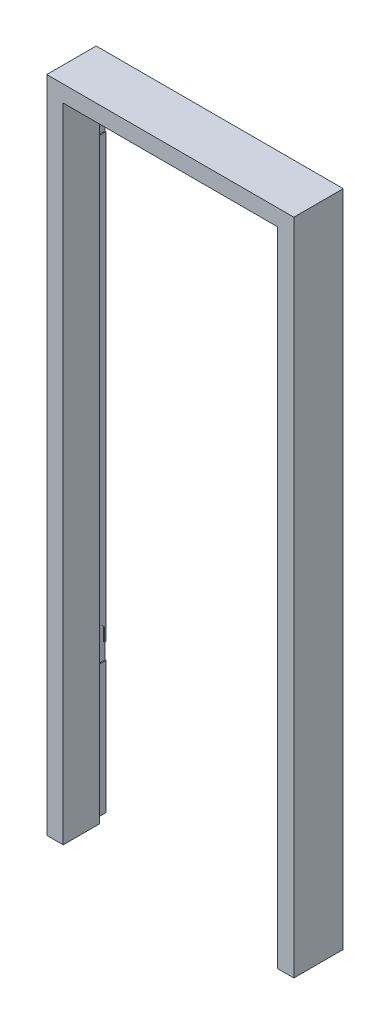
ISO-10303-21;
HEADER;
FILE_DESCRIPTION(('STEP AP214'),'2;1');
FILE_NAME('part.step','',(''),(''),'','','');
FILE_SCHEMA(('AUTOMOTIVE_DESIGN { 1 0 10303 214 1 1 1 1 }'));
ENDSEC;
DATA;
#1=APPLICATION_CONTEXT('core data for automotive mechanical design processes');
#2=APPLICATION_PROTOCOL_DEFINITION('international standard','automotive_design',2000,#1);
#3=PRODUCT_CONTEXT('',#1,'mechanical');
#4=PRODUCT('Part','Part','',(#3));
#5=PRODUCT_RELATED_PRODUCT_CATEGORY('part','',(#4));
#6=PRODUCT_DEFINITION_FORMATION('','',#4);
#7=PRODUCT_DEFINITION_CONTEXT('part definition',#1,'design');
#8=PRODUCT_DEFINITION('design','',#6,#7);
#9=PRODUCT_DEFINITION_SHAPE('','',#8);
#10=(LENGTH_UNIT() NAMED_UNIT(*) SI_UNIT(.MILLI.,.METRE.));
#11=(NAMED_UNIT(*) PLANE_ANGLE_UNIT() SI_UNIT($,.RADIAN.));
#12=(NAMED_UNIT(*) SI_UNIT($,.STERADIAN.) SOLID_ANGLE_UNIT());
#13=UNCERTAINTY_MEASURE_WITH_UNIT(LENGTH_MEASURE(1.E-05),#10,'distance_accuracy_value','');
#14=(GEOMETRIC_REPRESENTATION_CONTEXT(3) GLOBAL_UNCERTAINTY_ASSIGNED_CONTEXT((#13)) GLOBAL_UNIT_ASSIGNED_CONTEXT((#10,
#11,#12)) REPRESENTATION_CONTEXT('',''));
#15=CARTESIAN_POINT('',(0.,0.,0.));
#16=DIRECTION('',(0.,0.,1.));
#17=DIRECTION('',(1.,0.,0.));
#18=AXIS2_PLACEMENT_3D('',#15,#16,#17);
#19=CARTESIAN_POINT('',(-700.,-2000.,150.));
#20=DIRECTION('',(-1.,0.,0.));
#21=DIRECTION('',(0.,0.,1.));
#22=AXIS2_PLACEMENT_3D('',#19,#20,#21);
#23=PLANE('',#22);
#24=DIRECTION('',(0.,-1.,0.));
#25=VECTOR('',#24,1.);
#26=CARTESIAN_POINT('',(-700.,-2000.,40.));
#27=LINE('',#26,#25);
#28=CARTESIAN_POINT('',(-700.,-50.0000000000001,40.));
#29=VERTEX_POINT('',#28);
#30=CARTESIAN_POINT('',(-700.,-2000.,40.));
#31=VERTEX_POINT('',#30);
#32=EDGE_CURVE('E452',#29,#31,#27,.T.);
#33=ORIENTED_EDGE('',*,*,#32,.F.);
#34=DIRECTION('',(0.,0.,-1.));
#35=VECTOR('',#34,1.);
#36=CARTESIAN_POINT('',(-700.,-50.0000000000001,150.));
#37=LINE('',#36,#35);
#38=CARTESIAN_POINT('',(-700.,-50.0000000000001,150.));
#39=VERTEX_POINT('',#38);
#40=EDGE_CURVE('E509',#39,#29,#37,.T.);
#41=ORIENTED_EDGE('',*,*,#40,.F.);
#42=DIRECTION('',(0.,1.,0.));
#43=VECTOR('',#42,1.);
#44=CARTESIAN_POINT('',(-700.,-2000.,150.));
#45=LINE('',#44,#43);
#46=CARTESIAN_POINT('',(-700.,-2000.,150.));
#47=VERTEX_POINT('',#46);
#48=EDGE_CURVE('E470',#47,#39,#45,.T.);
#49=ORIENTED_EDGE('',*,*,#48,.F.);
#50=DIRECTION('',(0.,0.,-1.));
#51=VECTOR('',#50,1.);
#52=CARTESIAN_POINT('',(-700.,-2000.,150.));
#53=LINE('',#52,#51);
#54=EDGE_CURVE('E513',#47,#31,#53,.T.);
#55=ORIENTED_EDGE('',*,*,#54,.T.);
#56=EDGE_LOOP('',(#33,#41,#49,#55));
#57=FACE_BOUND('',#56,.T.);
#58=ADVANCED_FACE('F41',(#57),#23,.F.);
#59=CARTESIAN_POINT('',(-49.9999999999998,-50.,150.));
#60=DIRECTION('',(0.,1.,0.));
#61=DIRECTION('',(-1.,0.,0.));
#62=AXIS2_PLACEMENT_3D('',#59,#60,#61);
#63=PLANE('',#62);
#64=DIRECTION('',(-1.,0.,0.));
#65=VECTOR('',#64,1.);
#66=CARTESIAN_POINT('',(-49.9999999999998,-50.,40.));
#67=LINE('',#66,#65);
#68=CARTESIAN_POINT('',(-49.9999999999998,-49.9999999999998,40.));
#69=VERTEX_POINT('',#68);
#70=EDGE_CURVE('E449',#69,#29,#67,.T.);
#71=ORIENTED_EDGE('',*,*,#70,.F.);
#72=DIRECTION('',(0.,0.,-1.));
#73=VECTOR('',#72,1.);
#74=CARTESIAN_POINT('',(-49.9999999999998,-50.,150.));
#75=LINE('',#74,#73);
#76=CARTESIAN_POINT('',(-49.9999999999998,-50.,150.));
#77=VERTEX_POINT('',#76);
#78=EDGE_CURVE('E505',#77,#69,#75,.T.);
#79=ORIENTED_EDGE('',*,*,#78,.F.);
#80=DIRECTION('',(1.,0.,0.));
#81=VECTOR('',#80,1.);
#82=CARTESIAN_POINT('',(-49.9999999999998,-50.,150.));
#83=LINE('',#82,#81);
#84=EDGE_CURVE('E473',#39,#77,#83,.T.);
#85=ORIENTED_EDGE('',*,*,#84,.F.);
#86=ORIENTED_EDGE('',*,*,#40,.T.);
#87=EDGE_LOOP('',(#71,#79,#85,#86));
#88=FACE_BOUND('',#87,.T.);
#89=ADVANCED_FACE('F601',(#88),#63,.F.);
#90=CARTESIAN_POINT('',(-49.9999999999998,-2000.,150.));
#91=DIRECTION('',(1.,0.,0.));
#92=DIRECTION('',(0.,1.,0.));
#93=AXIS2_PLACEMENT_3D('',#90,#91,#92);
#94=PLANE('',#93);
#95=DIRECTION('',(0.,1.,0.));
#96=VECTOR('',#95,1.);
#97=CARTESIAN_POINT('',(-49.9999999999998,-2000.,40.));
#98=LINE('',#97,#96);
#99=CARTESIAN_POINT('',(-49.9999999999998,-2000.,40.));
#100=VERTEX_POINT('',#99);
#101=EDGE_CURVE('E436',#100,#69,#98,.T.);
#102=ORIENTED_EDGE('',*,*,#101,.F.);
#103=DIRECTION('',(0.,0.,-1.));
#104=VECTOR('',#103,1.);
#105=CARTESIAN_POINT('',(-49.9999999999998,-2000.,150.));
#106=LINE('',#105,#104);
#107=CARTESIAN_POINT('',(-49.9999999999998,-2000.,150.));
#108=VERTEX_POINT('',#107);
#109=EDGE_CURVE('E501',#108,#100,#106,.T.);
#110=ORIENTED_EDGE('',*,*,#109,.F.);
#111=DIRECTION('',(0.,-1.,0.));
#112=VECTOR('',#111,1.);
#113=CARTESIAN_POINT('',(-49.9999999999998,-2000.,150.));
#114=LINE('',#113,#112);
#115=EDGE_CURVE('E476',#77,#108,#114,.T.);
#116=ORIENTED_EDGE('',*,*,#115,.F.);
#117=ORIENTED_EDGE('',*,*,#78,.T.);
#118=EDGE_LOOP('',(#102,#110,#116,#117));
#119=FACE_BOUND('',#118,.T.);
#120=ADVANCED_FACE('F607',(#119),#94,.F.);
#121=CARTESIAN_POINT('',(0.,0.,150.));
#122=DIRECTION('',(-1.,0.,0.));
#123=DIRECTION('',(0.,0.,1.));
#124=AXIS2_PLACEMENT_3D('',#121,#122,#123);
#125=PLANE('',#124);
#126=DIRECTION('',(0.,1.,0.));
#127=VECTOR('',#126,1.);
#128=CARTESIAN_POINT('',(0.,0.,0.));
#129=LINE('',#128,#127);
#130=CARTESIAN_POINT('',(0.,-2000.,0.));
#131=VERTEX_POINT('',#130);
#132=CARTESIAN_POINT('',(0.,0.,0.));
#133=VERTEX_POINT('',#132);
#134=EDGE_CURVE('E455',#131,#133,#129,.T.);
#135=ORIENTED_EDGE('',*,*,#134,.T.);
#136=DIRECTION('',(0.,0.,-1.));
#137=VECTOR('',#136,1.);
#138=CARTESIAN_POINT('',(0.,0.,150.));
#139=LINE('',#138,#137);
#140=CARTESIAN_POINT('',(0.,0.,150.));
#141=VERTEX_POINT('',#140);
#142=EDGE_CURVE('E11',#141,#133,#139,.T.);
#143=ORIENTED_EDGE('',*,*,#142,.F.);
#144=DIRECTION('',(0.,1.,0.));
#145=VECTOR('',#144,1.);
#146=CARTESIAN_POINT('',(0.,0.,150.));
#147=LINE('',#146,#145);
#148=CARTESIAN_POINT('',(0.,-2000.,150.));
#149=VERTEX_POINT('',#148);
#150=EDGE_CURVE('E456',#149,#141,#147,.T.);
#151=ORIENTED_EDGE('',*,*,#150,.F.);
#152=DIRECTION('',(0.,0.,-1.));
#153=VECTOR('',#152,1.);
#154=CARTESIAN_POINT('',(0.,-2000.,150.));
#155=LINE('',#154,#153);
#156=EDGE_CURVE('E482',#149,#131,#155,.T.);
#157=ORIENTED_EDGE('',*,*,#156,.T.);
#158=EDGE_LOOP('',(#135,#143,#151,#157));
#159=FACE_BOUND('',#158,.T.);
#160=ADVANCED_FACE('F43',(#159),#125,.F.);
#161=CARTESIAN_POINT('',(0.,0.,150.));
#162=DIRECTION('',(0.,-1.,0.));
#163=DIRECTION('',(1.,0.,0.));
#164=AXIS2_PLACEMENT_3D('',#161,#162,#163);
#165=PLANE('',#164);
#166=DIRECTION('',(-1.,0.,0.));
#167=VECTOR('',#166,1.);
#168=CARTESIAN_POINT('',(0.,0.,0.));
#169=LINE('',#168,#167);
#170=CARTESIAN_POINT('',(-750.,0.,0.));
#171=VERTEX_POINT('',#170);
#172=EDGE_CURVE('E486',#133,#171,#169,.T.);
#173=ORIENTED_EDGE('',*,*,#172,.T.);
#174=DIRECTION('',(0.,0.,-1.));
#175=VECTOR('',#174,1.);
#176=CARTESIAN_POINT('',(-750.,0.,150.));
#177=LINE('',#176,#175);
#178=CARTESIAN_POINT('',(-750.,0.,150.));
#179=VERTEX_POINT('',#178);
#180=EDGE_CURVE('E50',#179,#171,#177,.T.);
#181=ORIENTED_EDGE('',*,*,#180,.F.);
#182=DIRECTION('',(-1.,0.,0.));
#183=VECTOR('',#182,1.);
#184=CARTESIAN_POINT('',(0.,0.,150.));
#185=LINE('',#184,#183);
#186=EDGE_CURVE('E460',#141,#179,#185,.T.);
#187=ORIENTED_EDGE('',*,*,#186,.F.);
#188=ORIENTED_EDGE('',*,*,#142,.T.);
#189=EDGE_LOOP('',(#173,#181,#187,#188));
#190=FACE_BOUND('',#189,.T.);
#191=ADVANCED_FACE('F544',(#190),#165,.F.);
#192=CARTESIAN_POINT('',(-750.,0.,150.));
#193=DIRECTION('',(1.,0.,0.));
#194=DIRECTION('',(0.,1.,0.));
#195=AXIS2_PLACEMENT_3D('',#192,#193,#194);
#196=PLANE('',#195);
#197=DIRECTION('',(0.,-1.,0.));
#198=VECTOR('',#197,1.);
#199=CARTESIAN_POINT('',(-750.,0.,0.));
#200=LINE('',#199,#198);
#201=CARTESIAN_POINT('',(-750.,-2000.,0.));
#202=VERTEX_POINT('',#201);
#203=EDGE_CURVE('E489',#171,#202,#200,.T.);
#204=ORIENTED_EDGE('',*,*,#203,.T.);
#205=DIRECTION('',(0.,0.,-1.));
#206=VECTOR('',#205,1.);
#207=CARTESIAN_POINT('',(-750.,-2000.,150.));
#208=LINE('',#207,#206);
#209=CARTESIAN_POINT('',(-750.,-2000.,150.));
#210=VERTEX_POINT('',#209);
#211=EDGE_CURVE('E517',#210,#202,#208,.T.);
#212=ORIENTED_EDGE('',*,*,#211,.F.);
#213=DIRECTION('',(0.,-1.,0.));
#214=VECTOR('',#213,1.);
#215=CARTESIAN_POINT('',(-750.,0.,150.));
#216=LINE('',#215,#214);
#217=EDGE_CURVE('E464',#179,#210,#216,.T.);
#218=ORIENTED_EDGE('',*,*,#217,.F.);
#219=ORIENTED_EDGE('',*,*,#180,.T.);
#220=EDGE_LOOP('',(#204,#212,#218,#219));
#221=FACE_BOUND('',#220,.T.);
#222=ADVANCED_FACE('F526',(#221),#196,.F.);
#223=CARTESIAN_POINT('',(-750.,-2000.,150.));
#224=DIRECTION('',(0.,1.,0.));
#225=DIRECTION('',(0.,0.,1.));
#226=AXIS2_PLACEMENT_3D('',#223,#224,#225);
#227=PLANE('',#226);
#228=DIRECTION('',(1.,0.,0.));
#229=VECTOR('',#228,1.);
#230=CARTESIAN_POINT('',(-750.,-2000.,0.));
#231=LINE('',#230,#229);
#232=CARTESIAN_POINT('',(-720.,-2000.,0.));
#233=VERTEX_POINT('',#232);
#234=EDGE_CURVE('E492',#202,#233,#231,.T.);
#235=ORIENTED_EDGE('',*,*,#234,.T.);
#236=DIRECTION('',(0.,0.,-1.));
#237=VECTOR('',#236,1.);
#238=CARTESIAN_POINT('',(-720.,-2000.,40.));
#239=LINE('',#238,#237);
#240=CARTESIAN_POINT('',(-720.,-2000.,40.));
#241=VERTEX_POINT('',#240);
#242=EDGE_CURVE('E441',#241,#233,#239,.T.);
#243=ORIENTED_EDGE('',*,*,#242,.F.);
#244=DIRECTION('',(-1.,0.,0.));
#245=VECTOR('',#244,1.);
#246=CARTESIAN_POINT('',(-30.0000000000002,-2000.,40.));
#247=LINE('',#246,#245);
#248=EDGE_CURVE('E408',#31,#241,#247,.T.);
#249=ORIENTED_EDGE('',*,*,#248,.F.);
#250=ORIENTED_EDGE('',*,*,#54,.F.);
#251=DIRECTION('',(1.,0.,0.));
#252=VECTOR('',#251,1.);
#253=CARTESIAN_POINT('',(-750.,-2000.,150.));
#254=LINE('',#253,#252);
#255=EDGE_CURVE('E467',#210,#47,#254,.T.);
#256=ORIENTED_EDGE('',*,*,#255,.F.);
#257=ORIENTED_EDGE('',*,*,#211,.T.);
#258=EDGE_LOOP('',(#235,#243,#249,#250,#256,#257));
#259=FACE_BOUND('',#258,.T.);
#260=ADVANCED_FACE('F534',(#259),#227,.F.);
#261=CARTESIAN_POINT('',(-49.9999999999998,-2000.,150.));
#262=DIRECTION('',(0.,1.,0.));
#263=DIRECTION('',(0.,0.,1.));
#264=AXIS2_PLACEMENT_3D('',#261,#262,#263);
#265=PLANE('',#264);
#266=CARTESIAN_POINT('',(-30.0000000000002,-2000.,40.));
#267=VERTEX_POINT('',#266);
#268=EDGE_CURVE('E410',#267,#100,#247,.T.);
#269=ORIENTED_EDGE('',*,*,#268,.F.);
#270=DIRECTION('',(0.,0.,-1.));
#271=VECTOR('',#270,1.);
#272=CARTESIAN_POINT('',(-30.0000000000002,-2000.,40.));
#273=LINE('',#272,#271);
#274=CARTESIAN_POINT('',(-30.0000000000002,-2000.,0.));
#275=VERTEX_POINT('',#274);
#276=EDGE_CURVE('E421',#267,#275,#273,.T.);
#277=ORIENTED_EDGE('',*,*,#276,.T.);
#278=DIRECTION('',(1.,0.,0.));
#279=VECTOR('',#278,1.);
#280=CARTESIAN_POINT('',(-49.9999999999998,-2000.,0.));
#281=LINE('',#280,#279);
#282=EDGE_CURVE('E461',#275,#131,#281,.T.);
#283=ORIENTED_EDGE('',*,*,#282,.T.);
#284=ORIENTED_EDGE('',*,*,#156,.F.);
#285=DIRECTION('',(1.,0.,0.));
#286=VECTOR('',#285,1.);
#287=CARTESIAN_POINT('',(-49.9999999999998,-2000.,150.));
#288=LINE('',#287,#286);
#289=EDGE_CURVE('E479',#108,#149,#288,.T.);
#290=ORIENTED_EDGE('',*,*,#289,.F.);
#291=ORIENTED_EDGE('',*,*,#109,.T.);
#292=EDGE_LOOP('',(#269,#277,#283,#284,#290,#291));
#293=FACE_BOUND('',#292,.T.);
#294=ADVANCED_FACE('F552',(#293),#265,.F.);
#295=CARTESIAN_POINT('',(0.,0.,150.));
#296=DIRECTION('',(0.,0.,1.));
#297=DIRECTION('',(1.,0.,0.));
#298=AXIS2_PLACEMENT_3D('',#295,#296,#297);
#299=PLANE('',#298);
#300=ORIENTED_EDGE('',*,*,#150,.T.);
#301=ORIENTED_EDGE('',*,*,#186,.T.);
#302=ORIENTED_EDGE('',*,*,#217,.T.);
#303=ORIENTED_EDGE('',*,*,#255,.T.);
#304=ORIENTED_EDGE('',*,*,#48,.T.);
#305=ORIENTED_EDGE('',*,*,#84,.T.);
#306=ORIENTED_EDGE('',*,*,#115,.T.);
#307=ORIENTED_EDGE('',*,*,#289,.T.);
#308=EDGE_LOOP('',(#300,#301,#302,#303,#304,#305,#306,#307));
#309=FACE_BOUND('',#308,.T.);
#310=ADVANCED_FACE('F540',(#309),#299,.T.);
#311=CARTESIAN_POINT('',(0.,0.,0.));
#312=DIRECTION('',(0.,0.,1.));
#313=DIRECTION('',(1.,0.,0.));
#314=AXIS2_PLACEMENT_3D('',#311,#312,#313);
#315=PLANE('',#314);
#316=DIRECTION('',(0.,1.,0.));
#317=VECTOR('',#316,1.);
#318=CARTESIAN_POINT('',(-723.,-160.,0.));
#319=LINE('',#318,#317);
#320=CARTESIAN_POINT('',(-723.,-210.,0.));
#321=VERTEX_POINT('',#320);
#322=CARTESIAN_POINT('',(-723.,-160.,0.));
#323=VERTEX_POINT('',#322);
#324=EDGE_CURVE('E246',#321,#323,#319,.T.);
#325=ORIENTED_EDGE('',*,*,#324,.F.);
#326=DIRECTION('',(1.,0.,0.));
#327=VECTOR('',#326,1.);
#328=CARTESIAN_POINT('',(-723.,-210.,0.));
#329=LINE('',#328,#327);
#330=CARTESIAN_POINT('',(-720.,-210.,0.));
#331=VERTEX_POINT('',#330);
#332=EDGE_CURVE('E228',#321,#331,#329,.T.);
#333=ORIENTED_EDGE('',*,*,#332,.T.);
#334=DIRECTION('',(0.,1.,0.));
#335=VECTOR('',#334,1.);
#336=CARTESIAN_POINT('',(-720.,-30.,0.));
#337=LINE('',#336,#335);
#338=CARTESIAN_POINT('',(-720.,-1550.,0.));
#339=VERTEX_POINT('',#338);
#340=EDGE_CURVE('E429',#339,#331,#337,.T.);
#341=ORIENTED_EDGE('',*,*,#340,.F.);
#342=DIRECTION('',(1.,0.,0.));
#343=VECTOR('',#342,1.);
#344=CARTESIAN_POINT('',(-723.,-1550.,0.));
#345=LINE('',#344,#343);
#346=CARTESIAN_POINT('',(-723.,-1550.,0.));
#347=VERTEX_POINT('',#346);
#348=EDGE_CURVE('E348',#347,#339,#345,.T.);
#349=ORIENTED_EDGE('',*,*,#348,.F.);
#350=DIRECTION('',(0.,1.,0.));
#351=VECTOR('',#350,1.);
#352=CARTESIAN_POINT('',(-723.,-1550.,0.));
#353=LINE('',#352,#351);
#354=CARTESIAN_POINT('',(-723.,-1600.,0.));
#355=VERTEX_POINT('',#354);
#356=EDGE_CURVE('E314',#355,#347,#353,.T.);
#357=ORIENTED_EDGE('',*,*,#356,.F.);
#358=DIRECTION('',(1.,0.,0.));
#359=VECTOR('',#358,1.);
#360=CARTESIAN_POINT('',(-723.,-1600.,0.));
#361=LINE('',#360,#359);
#362=CARTESIAN_POINT('',(-720.,-1600.,0.));
#363=VERTEX_POINT('',#362);
#364=EDGE_CURVE('E351',#355,#363,#361,.T.);
#365=ORIENTED_EDGE('',*,*,#364,.T.);
#366=EDGE_CURVE('E425',#233,#363,#337,.T.);
#367=ORIENTED_EDGE('',*,*,#366,.F.);
#368=ORIENTED_EDGE('',*,*,#234,.F.);
#369=ORIENTED_EDGE('',*,*,#203,.F.);
#370=ORIENTED_EDGE('',*,*,#172,.F.);
#371=ORIENTED_EDGE('',*,*,#134,.F.);
#372=ORIENTED_EDGE('',*,*,#282,.F.);
#373=DIRECTION('',(0.,-1.,0.));
#374=VECTOR('',#373,1.);
#375=CARTESIAN_POINT('',(-30.,-30.,0.));
#376=LINE('',#375,#374);
#377=CARTESIAN_POINT('',(-30.,-30.,0.));
#378=VERTEX_POINT('',#377);
#379=EDGE_CURVE('E394',#378,#275,#376,.T.);
#380=ORIENTED_EDGE('',*,*,#379,.F.);
#381=DIRECTION('',(1.,0.,0.));
#382=VECTOR('',#381,1.);
#383=CARTESIAN_POINT('',(-30.,-30.,0.));
#384=LINE('',#383,#382);
#385=CARTESIAN_POINT('',(-720.,-30.,0.));
#386=VERTEX_POINT('',#385);
#387=EDGE_CURVE('E409',#386,#378,#384,.T.);
#388=ORIENTED_EDGE('',*,*,#387,.F.);
#389=CARTESIAN_POINT('',(-720.,-160.,0.));
#390=VERTEX_POINT('',#389);
#391=EDGE_CURVE('E424',#390,#386,#337,.T.);
#392=ORIENTED_EDGE('',*,*,#391,.F.);
#393=DIRECTION('',(1.,0.,0.));
#394=VECTOR('',#393,1.);
#395=CARTESIAN_POINT('',(-723.,-160.,0.));
#396=LINE('',#395,#394);
#397=EDGE_CURVE('E65',#323,#390,#396,.T.);
#398=ORIENTED_EDGE('',*,*,#397,.F.);
#399=EDGE_LOOP('',(#325,#333,#341,#349,#357,#365,#367,#368,#369,#370,#371,#372,#380,#388,#392,#398));
#400=FACE_BOUND('',#399,.T.);
#401=ADVANCED_FACE('F252',(#400),#315,.F.);
#402=CARTESIAN_POINT('',(0.,0.,40.));
#403=DIRECTION('',(0.,0.,-1.));
#404=DIRECTION('',(-1.,0.,0.));
#405=AXIS2_PLACEMENT_3D('',#402,#403,#404);
#406=PLANE('',#405);
#407=ORIENTED_EDGE('',*,*,#32,.T.);
#408=ORIENTED_EDGE('',*,*,#248,.T.);
#409=DIRECTION('',(0.,1.,0.));
#410=VECTOR('',#409,1.);
#411=CARTESIAN_POINT('',(-720.,-30.,40.));
#412=LINE('',#411,#410);
#413=CARTESIAN_POINT('',(-720.,-30.,40.));
#414=VERTEX_POINT('',#413);
#415=EDGE_CURVE('E413',#241,#414,#412,.T.);
#416=ORIENTED_EDGE('',*,*,#415,.T.);
#417=DIRECTION('',(1.,0.,0.));
#418=VECTOR('',#417,1.);
#419=CARTESIAN_POINT('',(-30.,-30.,40.));
#420=LINE('',#419,#418);
#421=CARTESIAN_POINT('',(-30.,-30.,40.));
#422=VERTEX_POINT('',#421);
#423=EDGE_CURVE('E417',#414,#422,#420,.T.);
#424=ORIENTED_EDGE('',*,*,#423,.T.);
#425=DIRECTION('',(0.,-1.,0.));
#426=VECTOR('',#425,1.);
#427=CARTESIAN_POINT('',(-30.,-30.,40.));
#428=LINE('',#427,#426);
#429=EDGE_CURVE('E404',#422,#267,#428,.T.);
#430=ORIENTED_EDGE('',*,*,#429,.T.);
#431=ORIENTED_EDGE('',*,*,#268,.T.);
#432=ORIENTED_EDGE('',*,*,#101,.T.);
#433=ORIENTED_EDGE('',*,*,#70,.T.);
#434=EDGE_LOOP('',(#407,#408,#416,#424,#430,#431,#432,#433));
#435=FACE_BOUND('',#434,.T.);
#436=ADVANCED_FACE('F558',(#435),#406,.T.);
#437=CARTESIAN_POINT('',(-30.,-30.,40.));
#438=DIRECTION('',(1.,0.,0.));
#439=DIRECTION('',(0.,1.,0.));
#440=AXIS2_PLACEMENT_3D('',#437,#438,#439);
#441=PLANE('',#440);
#442=DIRECTION('',(0.,0.,1.));
#443=VECTOR('',#442,1.);
#444=CARTESIAN_POINT('',(-30.0000000000001,-1130.,5.00000000000002));
#445=LINE('',#444,#443);
#446=CARTESIAN_POINT('',(-30.0000000000001,-1130.,5.00000000000002));
#447=VERTEX_POINT('',#446);
#448=CARTESIAN_POINT('',(-30.0000000000001,-1130.,35.));
#449=VERTEX_POINT('',#448);
#450=EDGE_CURVE('E380',#447,#449,#445,.T.);
#451=ORIENTED_EDGE('',*,*,#450,.F.);
#452=DIRECTION('',(0.,-1.,0.));
#453=VECTOR('',#452,1.);
#454=CARTESIAN_POINT('',(-30.0000000000001,-960.,5.));
#455=LINE('',#454,#453);
#456=CARTESIAN_POINT('',(-30.0000000000001,-960.,5.));
#457=VERTEX_POINT('',#456);
#458=EDGE_CURVE('E289',#457,#447,#455,.T.);
#459=ORIENTED_EDGE('',*,*,#458,.F.);
#460=DIRECTION('',(0.,0.,-1.));
#461=VECTOR('',#460,1.);
#462=CARTESIAN_POINT('',(-30.0000000000001,-960.,5.));
#463=LINE('',#462,#461);
#464=CARTESIAN_POINT('',(-30.0000000000001,-960.,35.));
#465=VERTEX_POINT('',#464);
#466=EDGE_CURVE('E365',#465,#457,#463,.T.);
#467=ORIENTED_EDGE('',*,*,#466,.F.);
#468=DIRECTION('',(0.,1.,0.));
#469=VECTOR('',#468,1.);
#470=CARTESIAN_POINT('',(-30.0000000000001,-960.,35.));
#471=LINE('',#470,#469);
#472=EDGE_CURVE('E384',#449,#465,#471,.T.);
#473=ORIENTED_EDGE('',*,*,#472,.F.);
#474=EDGE_LOOP('',(#451,#459,#467,#473));
#475=FACE_BOUND('',#474,.T.);
#476=ORIENTED_EDGE('',*,*,#379,.T.);
#477=ORIENTED_EDGE('',*,*,#276,.F.);
#478=ORIENTED_EDGE('',*,*,#429,.F.);
#479=DIRECTION('',(0.,0.,-1.));
#480=VECTOR('',#479,1.);
#481=CARTESIAN_POINT('',(-30.,-30.,40.));
#482=LINE('',#481,#480);
#483=EDGE_CURVE('E433',#422,#378,#482,.T.);
#484=ORIENTED_EDGE('',*,*,#483,.T.);
#485=EDGE_LOOP('',(#476,#477,#478,#484));
#486=FACE_BOUND('',#485,.T.);
#487=ADVANCED_FACE('F556',(#475,#486),#441,.F.);
#488=CARTESIAN_POINT('',(-30.,-30.,40.));
#489=DIRECTION('',(0.,1.,0.));
#490=DIRECTION('',(0.,0.,1.));
#491=AXIS2_PLACEMENT_3D('',#488,#489,#490);
#492=PLANE('',#491);
#493=ORIENTED_EDGE('',*,*,#387,.T.);
#494=ORIENTED_EDGE('',*,*,#483,.F.);
#495=ORIENTED_EDGE('',*,*,#423,.F.);
#496=DIRECTION('',(0.,0.,-1.));
#497=VECTOR('',#496,1.);
#498=CARTESIAN_POINT('',(-720.,-30.,40.));
#499=LINE('',#498,#497);
#500=EDGE_CURVE('E437',#414,#386,#499,.T.);
#501=ORIENTED_EDGE('',*,*,#500,.T.);
#502=EDGE_LOOP('',(#493,#494,#495,#501));
#503=FACE_BOUND('',#502,.T.);
#504=ADVANCED_FACE('F563',(#503),#492,.F.);
#505=CARTESIAN_POINT('',(-720.,-30.,40.));
#506=DIRECTION('',(-1.,0.,0.));
#507=DIRECTION('',(0.,-1.,0.));
#508=AXIS2_PLACEMENT_3D('',#505,#506,#507);
#509=PLANE('',#508);
#510=ORIENTED_EDGE('',*,*,#340,.T.);
#511=DIRECTION('',(0.,0.,-1.));
#512=VECTOR('',#511,1.);
#513=CARTESIAN_POINT('',(-720.,-210.,0.));
#514=LINE('',#513,#512);
#515=CARTESIAN_POINT('',(-720.,-210.,35.));
#516=VERTEX_POINT('',#515);
#517=EDGE_CURVE('E234',#516,#331,#514,.T.);
#518=ORIENTED_EDGE('',*,*,#517,.F.);
#519=DIRECTION('',(0.,-1.,0.));
#520=VECTOR('',#519,1.);
#521=CARTESIAN_POINT('',(-720.,-120.,35.));
#522=LINE('',#521,#520);
#523=CARTESIAN_POINT('',(-720.,-120.,35.));
#524=VERTEX_POINT('',#523);
#525=EDGE_CURVE('E250',#524,#516,#522,.T.);
#526=ORIENTED_EDGE('',*,*,#525,.F.);
#527=CARTESIAN_POINT('',(-720.,-126.25,20.));
#528=DIRECTION('',(1.,0.,0.));
#529=DIRECTION('',(0.,-1.,0.));
#530=AXIS2_PLACEMENT_3D('',#527,#528,#529);
#531=CIRCLE('',#530,16.25);
#532=CARTESIAN_POINT('',(-720.,-120.,5.));
#533=VERTEX_POINT('',#532);
#534=EDGE_CURVE('E279',#533,#524,#531,.T.);
#535=ORIENTED_EDGE('',*,*,#534,.F.);
#536=DIRECTION('',(0.,1.,0.));
#537=VECTOR('',#536,1.);
#538=CARTESIAN_POINT('',(-720.,-120.,5.));
#539=LINE('',#538,#537);
#540=CARTESIAN_POINT('',(-720.,-160.,4.99999999999999));
#541=VERTEX_POINT('',#540);
#542=EDGE_CURVE('E275',#541,#533,#539,.T.);
#543=ORIENTED_EDGE('',*,*,#542,.F.);
#544=DIRECTION('',(0.,0.,1.));
#545=VECTOR('',#544,1.);
#546=CARTESIAN_POINT('',(-720.,-160.,4.99999999999999));
#547=LINE('',#546,#545);
#548=EDGE_CURVE('E271',#390,#541,#547,.T.);
#549=ORIENTED_EDGE('',*,*,#548,.F.);
#550=ORIENTED_EDGE('',*,*,#391,.T.);
#551=ORIENTED_EDGE('',*,*,#500,.F.);
#552=ORIENTED_EDGE('',*,*,#415,.F.);
#553=ORIENTED_EDGE('',*,*,#242,.T.);
#554=ORIENTED_EDGE('',*,*,#366,.T.);
#555=DIRECTION('',(0.,0.,-1.));
#556=VECTOR('',#555,1.);
#557=CARTESIAN_POINT('',(-720.,-1600.,0.));
#558=LINE('',#557,#556);
#559=CARTESIAN_POINT('',(-720.,-1600.,35.));
#560=VERTEX_POINT('',#559);
#561=EDGE_CURVE('E333',#560,#363,#558,.T.);
#562=ORIENTED_EDGE('',*,*,#561,.F.);
#563=DIRECTION('',(0.,-1.,0.));
#564=VECTOR('',#563,1.);
#565=CARTESIAN_POINT('',(-720.,-1510.,35.));
#566=LINE('',#565,#564);
#567=CARTESIAN_POINT('',(-720.,-1510.,35.));
#568=VERTEX_POINT('',#567);
#569=EDGE_CURVE('E329',#568,#560,#566,.T.);
#570=ORIENTED_EDGE('',*,*,#569,.F.);
#571=CARTESIAN_POINT('',(-720.,-1516.25,20.));
#572=DIRECTION('',(1.,0.,0.));
#573=DIRECTION('',(0.,-1.,0.));
#574=AXIS2_PLACEMENT_3D('',#571,#572,#573);
#575=CIRCLE('',#574,16.2499999999999);
#576=CARTESIAN_POINT('',(-720.,-1510.,5.00000000000004));
#577=VERTEX_POINT('',#576);
#578=EDGE_CURVE('E57',#577,#568,#575,.T.);
#579=ORIENTED_EDGE('',*,*,#578,.F.);
#580=DIRECTION('',(0.,1.,0.));
#581=VECTOR('',#580,1.);
#582=CARTESIAN_POINT('',(-720.,-1510.,5.00000000000004));
#583=LINE('',#582,#581);
#584=CARTESIAN_POINT('',(-720.,-1550.,5.00000000000004));
#585=VERTEX_POINT('',#584);
#586=EDGE_CURVE('E306',#585,#577,#583,.T.);
#587=ORIENTED_EDGE('',*,*,#586,.F.);
#588=DIRECTION('',(0.,0.,1.));
#589=VECTOR('',#588,1.);
#590=CARTESIAN_POINT('',(-720.,-1550.,5.00000000000004));
#591=LINE('',#590,#589);
#592=EDGE_CURVE('E336',#339,#585,#591,.T.);
#593=ORIENTED_EDGE('',*,*,#592,.F.);
#594=EDGE_LOOP('',(#510,#518,#526,#535,#543,#549,#550,#551,#552,#553,#554,#562,#570,#579,#587,#593));
#595=FACE_BOUND('',#594,.T.);
#596=ADVANCED_FACE('F568',(#595),#509,.F.);
#597=CARTESIAN_POINT('',(-25.0000000000001,-960.,5.));
#598=DIRECTION('',(0.,0.,-1.));
#599=DIRECTION('',(0.,1.,0.));
#600=AXIS2_PLACEMENT_3D('',#597,#598,#599);
#601=PLANE('',#600);
#602=ORIENTED_EDGE('',*,*,#458,.T.);
#603=DIRECTION('',(-1.,0.,0.));
#604=VECTOR('',#603,1.);
#605=CARTESIAN_POINT('',(-25.0000000000001,-1130.,5.00000000000002));
#606=LINE('',#605,#604);
#607=CARTESIAN_POINT('',(-25.0000000000001,-1130.,5.00000000000002));
#608=VERTEX_POINT('',#607);
#609=EDGE_CURVE('E377',#608,#447,#606,.T.);
#610=ORIENTED_EDGE('',*,*,#609,.F.);
#611=DIRECTION('',(0.,-1.,0.));
#612=VECTOR('',#611,1.);
#613=CARTESIAN_POINT('',(-25.0000000000001,-960.,5.));
#614=LINE('',#613,#612);
#615=CARTESIAN_POINT('',(-25.0000000000001,-960.,5.));
#616=VERTEX_POINT('',#615);
#617=EDGE_CURVE('E360',#616,#608,#614,.T.);
#618=ORIENTED_EDGE('',*,*,#617,.F.);
#619=DIRECTION('',(-1.,0.,0.));
#620=VECTOR('',#619,1.);
#621=CARTESIAN_POINT('',(-25.0000000000001,-960.,5.));
#622=LINE('',#621,#620);
#623=EDGE_CURVE('E391',#616,#457,#622,.T.);
#624=ORIENTED_EDGE('',*,*,#623,.T.);
#625=EDGE_LOOP('',(#602,#610,#618,#624));
#626=FACE_BOUND('',#625,.T.);
#627=ADVANCED_FACE('F638',(#626),#601,.F.);
#628=CARTESIAN_POINT('',(-25.0000000000001,-960.,5.));
#629=DIRECTION('',(0.,1.,0.));
#630=DIRECTION('',(-1.,0.,0.));
#631=AXIS2_PLACEMENT_3D('',#628,#629,#630);
#632=PLANE('',#631);
#633=ORIENTED_EDGE('',*,*,#466,.T.);
#634=ORIENTED_EDGE('',*,*,#623,.F.);
#635=DIRECTION('',(0.,0.,-1.));
#636=VECTOR('',#635,1.);
#637=CARTESIAN_POINT('',(-25.0000000000001,-960.,5.));
#638=LINE('',#637,#636);
#639=CARTESIAN_POINT('',(-25.0000000000001,-960.,35.));
#640=VERTEX_POINT('',#639);
#641=EDGE_CURVE('E373',#640,#616,#638,.T.);
#642=ORIENTED_EDGE('',*,*,#641,.F.);
#643=DIRECTION('',(-1.,0.,0.));
#644=VECTOR('',#643,1.);
#645=CARTESIAN_POINT('',(-25.0000000000001,-960.,35.));
#646=LINE('',#645,#644);
#647=EDGE_CURVE('E395',#640,#465,#646,.T.);
#648=ORIENTED_EDGE('',*,*,#647,.T.);
#649=EDGE_LOOP('',(#633,#634,#642,#648));
#650=FACE_BOUND('',#649,.T.);
#651=ADVANCED_FACE('F645',(#650),#632,.F.);
#652=CARTESIAN_POINT('',(-25.0000000000001,-960.,35.));
#653=DIRECTION('',(0.,0.,1.));
#654=DIRECTION('',(0.,-1.,0.));
#655=AXIS2_PLACEMENT_3D('',#652,#653,#654);
#656=PLANE('',#655);
#657=ORIENTED_EDGE('',*,*,#472,.T.);
#658=ORIENTED_EDGE('',*,*,#647,.F.);
#659=DIRECTION('',(0.,1.,0.));
#660=VECTOR('',#659,1.);
#661=CARTESIAN_POINT('',(-25.0000000000001,-960.,35.));
#662=LINE('',#661,#660);
#663=CARTESIAN_POINT('',(-25.0000000000001,-1130.,35.));
#664=VERTEX_POINT('',#663);
#665=EDGE_CURVE('E369',#664,#640,#662,.T.);
#666=ORIENTED_EDGE('',*,*,#665,.F.);
#667=DIRECTION('',(-1.,0.,0.));
#668=VECTOR('',#667,1.);
#669=CARTESIAN_POINT('',(-25.0000000000001,-1130.,35.));
#670=LINE('',#669,#668);
#671=EDGE_CURVE('E398',#664,#449,#670,.T.);
#672=ORIENTED_EDGE('',*,*,#671,.T.);
#673=EDGE_LOOP('',(#657,#658,#666,#672));
#674=FACE_BOUND('',#673,.T.);
#675=ADVANCED_FACE('F650',(#674),#656,.F.);
#676=CARTESIAN_POINT('',(-25.0000000000001,-1130.,5.00000000000002));
#677=DIRECTION('',(0.,-1.,0.));
#678=DIRECTION('',(1.,0.,0.));
#679=AXIS2_PLACEMENT_3D('',#676,#677,#678);
#680=PLANE('',#679);
#681=ORIENTED_EDGE('',*,*,#450,.T.);
#682=ORIENTED_EDGE('',*,*,#671,.F.);
#683=DIRECTION('',(0.,0.,1.));
#684=VECTOR('',#683,1.);
#685=CARTESIAN_POINT('',(-25.0000000000001,-1130.,5.00000000000002));
#686=LINE('',#685,#684);
#687=EDGE_CURVE('E364',#608,#664,#686,.T.);
#688=ORIENTED_EDGE('',*,*,#687,.F.);
#689=ORIENTED_EDGE('',*,*,#609,.T.);
#690=EDGE_LOOP('',(#681,#682,#688,#689));
#691=FACE_BOUND('',#690,.T.);
#692=ADVANCED_FACE('F647',(#691),#680,.F.);
#693=CARTESIAN_POINT('',(-25.,0.,0.));
#694=DIRECTION('',(-1.,0.,0.));
#695=DIRECTION('',(0.,-1.,0.));
#696=AXIS2_PLACEMENT_3D('',#693,#694,#695);
#697=PLANE('',#696);
#698=ORIENTED_EDGE('',*,*,#617,.T.);
#699=ORIENTED_EDGE('',*,*,#687,.T.);
#700=ORIENTED_EDGE('',*,*,#665,.T.);
#701=ORIENTED_EDGE('',*,*,#641,.T.);
#702=EDGE_LOOP('',(#698,#699,#700,#701));
#703=FACE_BOUND('',#702,.T.);
#704=ADVANCED_FACE('F597',(#703),#697,.T.);
#705=CARTESIAN_POINT('',(-723.,-1516.25,20.));
#706=DIRECTION('',(1.,0.,0.));
#707=DIRECTION('',(0.,1.,0.));
#708=AXIS2_PLACEMENT_3D('',#705,#706,#707);
#709=CYLINDRICAL_SURFACE('',#708,16.2499999999999);
#710=ORIENTED_EDGE('',*,*,#578,.T.);
#711=DIRECTION('',(1.,0.,0.));
#712=VECTOR('',#711,1.);
#713=CARTESIAN_POINT('',(-723.,-1510.,35.));
#714=LINE('',#713,#712);
#715=CARTESIAN_POINT('',(-723.,-1510.,35.));
#716=VERTEX_POINT('',#715);
#717=EDGE_CURVE('E326',#716,#568,#714,.T.);
#718=ORIENTED_EDGE('',*,*,#717,.F.);
#719=CARTESIAN_POINT('',(-723.,-1516.25,20.));
#720=DIRECTION('',(1.,0.,0.));
#721=DIRECTION('',(0.,-1.,0.));
#722=AXIS2_PLACEMENT_3D('',#719,#720,#721);
#723=CIRCLE('',#722,16.2499999999999);
#724=CARTESIAN_POINT('',(-723.,-1510.,5.00000000000004));
#725=VERTEX_POINT('',#724);
#726=EDGE_CURVE('E301',#725,#716,#723,.T.);
#727=ORIENTED_EDGE('',*,*,#726,.F.);
#728=DIRECTION('',(1.,0.,0.));
#729=VECTOR('',#728,1.);
#730=CARTESIAN_POINT('',(-723.,-1510.,5.00000000000004));
#731=LINE('',#730,#729);
#732=EDGE_CURVE('E272',#725,#577,#731,.T.);
#733=ORIENTED_EDGE('',*,*,#732,.T.);
#734=EDGE_LOOP('',(#710,#718,#727,#733));
#735=FACE_BOUND('',#734,.T.);
#736=ADVANCED_FACE('F587',(#735),#709,.F.);
#737=CARTESIAN_POINT('',(-723.,-1510.,5.00000000000004));
#738=DIRECTION('',(0.,0.,-1.));
#739=DIRECTION('',(0.,1.,0.));
#740=AXIS2_PLACEMENT_3D('',#737,#738,#739);
#741=PLANE('',#740);
#742=ORIENTED_EDGE('',*,*,#586,.T.);
#743=ORIENTED_EDGE('',*,*,#732,.F.);
#744=DIRECTION('',(0.,1.,0.));
#745=VECTOR('',#744,1.);
#746=CARTESIAN_POINT('',(-723.,-1510.,5.00000000000004));
#747=LINE('',#746,#745);
#748=CARTESIAN_POINT('',(-723.,-1550.,5.00000000000004));
#749=VERTEX_POINT('',#748);
#750=EDGE_CURVE('E322',#749,#725,#747,.T.);
#751=ORIENTED_EDGE('',*,*,#750,.F.);
#752=DIRECTION('',(1.,0.,0.));
#753=VECTOR('',#752,1.);
#754=CARTESIAN_POINT('',(-723.,-1550.,5.00000000000004));
#755=LINE('',#754,#753);
#756=EDGE_CURVE('E345',#749,#585,#755,.T.);
#757=ORIENTED_EDGE('',*,*,#756,.T.);
#758=EDGE_LOOP('',(#742,#743,#751,#757));
#759=FACE_BOUND('',#758,.T.);
#760=ADVANCED_FACE('F589',(#759),#741,.F.);
#761=CARTESIAN_POINT('',(-723.,-1550.,5.00000000000004));
#762=DIRECTION('',(0.,1.,0.));
#763=DIRECTION('',(-1.,0.,0.));
#764=AXIS2_PLACEMENT_3D('',#761,#762,#763);
#765=PLANE('',#764);
#766=ORIENTED_EDGE('',*,*,#592,.T.);
#767=ORIENTED_EDGE('',*,*,#756,.F.);
#768=DIRECTION('',(0.,0.,1.));
#769=VECTOR('',#768,1.);
#770=CARTESIAN_POINT('',(-723.,-1550.,5.00000000000004));
#771=LINE('',#770,#769);
#772=EDGE_CURVE('E318',#347,#749,#771,.T.);
#773=ORIENTED_EDGE('',*,*,#772,.F.);
#774=ORIENTED_EDGE('',*,*,#348,.T.);
#775=EDGE_LOOP('',(#766,#767,#773,#774));
#776=FACE_BOUND('',#775,.T.);
#777=ADVANCED_FACE('F574',(#776),#765,.F.);
#778=CARTESIAN_POINT('',(-723.,-1600.,0.));
#779=DIRECTION('',(0.,-1.,0.));
#780=DIRECTION('',(1.,0.,0.));
#781=AXIS2_PLACEMENT_3D('',#778,#779,#780);
#782=PLANE('',#781);
#783=ORIENTED_EDGE('',*,*,#561,.T.);
#784=ORIENTED_EDGE('',*,*,#364,.F.);
#785=DIRECTION('',(0.,0.,-1.));
#786=VECTOR('',#785,1.);
#787=CARTESIAN_POINT('',(-723.,-1600.,0.));
#788=LINE('',#787,#786);
#789=CARTESIAN_POINT('',(-723.,-1600.,35.));
#790=VERTEX_POINT('',#789);
#791=EDGE_CURVE('E310',#790,#355,#788,.T.);
#792=ORIENTED_EDGE('',*,*,#791,.F.);
#793=DIRECTION('',(1.,0.,0.));
#794=VECTOR('',#793,1.);
#795=CARTESIAN_POINT('',(-723.,-1600.,35.));
#796=LINE('',#795,#794);
#797=EDGE_CURVE('E355',#790,#560,#796,.T.);
#798=ORIENTED_EDGE('',*,*,#797,.T.);
#799=EDGE_LOOP('',(#783,#784,#792,#798));
#800=FACE_BOUND('',#799,.T.);
#801=ADVANCED_FACE('F581',(#800),#782,.F.);
#802=CARTESIAN_POINT('',(-723.,-1510.,35.));
#803=DIRECTION('',(0.,0.,1.));
#804=DIRECTION('',(0.,-1.,0.));
#805=AXIS2_PLACEMENT_3D('',#802,#803,#804);
#806=PLANE('',#805);
#807=ORIENTED_EDGE('',*,*,#569,.T.);
#808=ORIENTED_EDGE('',*,*,#797,.F.);
#809=DIRECTION('',(0.,-1.,0.));
#810=VECTOR('',#809,1.);
#811=CARTESIAN_POINT('',(-723.,-1510.,35.));
#812=LINE('',#811,#810);
#813=EDGE_CURVE('E305',#716,#790,#812,.T.);
#814=ORIENTED_EDGE('',*,*,#813,.F.);
#815=ORIENTED_EDGE('',*,*,#717,.T.);
#816=EDGE_LOOP('',(#807,#808,#814,#815));
#817=FACE_BOUND('',#816,.T.);
#818=ADVANCED_FACE('F585',(#817),#806,.F.);
#819=CARTESIAN_POINT('',(-723.,-1516.25,20.));
#820=DIRECTION('',(-1.,0.,0.));
#821=DIRECTION('',(0.,-1.,0.));
#822=AXIS2_PLACEMENT_3D('',#819,#820,#821);
#823=PLANE('',#822);
#824=ORIENTED_EDGE('',*,*,#726,.T.);
#825=ORIENTED_EDGE('',*,*,#813,.T.);
#826=ORIENTED_EDGE('',*,*,#791,.T.);
#827=ORIENTED_EDGE('',*,*,#356,.T.);
#828=ORIENTED_EDGE('',*,*,#772,.T.);
#829=ORIENTED_EDGE('',*,*,#750,.T.);
#830=EDGE_LOOP('',(#824,#825,#826,#827,#828,#829));
#831=FACE_BOUND('',#830,.T.);
#832=ADVANCED_FACE('F577',(#831),#823,.F.);
#833=CARTESIAN_POINT('',(-723.,-210.,0.));
#834=DIRECTION('',(0.,-1.,0.));
#835=DIRECTION('',(1.,0.,0.));
#836=AXIS2_PLACEMENT_3D('',#833,#834,#835);
#837=PLANE('',#836);
#838=ORIENTED_EDGE('',*,*,#517,.T.);
#839=ORIENTED_EDGE('',*,*,#332,.F.);
#840=DIRECTION('',(0.,0.,-1.));
#841=VECTOR('',#840,1.);
#842=CARTESIAN_POINT('',(-723.,-210.,0.));
#843=LINE('',#842,#841);
#844=CARTESIAN_POINT('',(-723.,-210.,35.));
#845=VERTEX_POINT('',#844);
#846=EDGE_CURVE('E231',#845,#321,#843,.T.);
#847=ORIENTED_EDGE('',*,*,#846,.F.);
#848=DIRECTION('',(1.,0.,0.));
#849=VECTOR('',#848,1.);
#850=CARTESIAN_POINT('',(-723.,-210.,35.));
#851=LINE('',#850,#849);
#852=EDGE_CURVE('E286',#845,#516,#851,.T.);
#853=ORIENTED_EDGE('',*,*,#852,.T.);
#854=EDGE_LOOP('',(#838,#839,#847,#853));
#855=FACE_BOUND('',#854,.T.);
#856=ADVANCED_FACE('F230',(#855),#837,.F.);
#857=CARTESIAN_POINT('',(-723.,-120.,35.));
#858=DIRECTION('',(0.,0.,1.));
#859=DIRECTION('',(0.,-1.,0.));
#860=AXIS2_PLACEMENT_3D('',#857,#858,#859);
#861=PLANE('',#860);
#862=ORIENTED_EDGE('',*,*,#525,.T.);
#863=ORIENTED_EDGE('',*,*,#852,.F.);
#864=DIRECTION('',(0.,-1.,0.));
#865=VECTOR('',#864,1.);
#866=CARTESIAN_POINT('',(-723.,-120.,35.));
#867=LINE('',#866,#865);
#868=CARTESIAN_POINT('',(-723.,-120.,35.));
#869=VERTEX_POINT('',#868);
#870=EDGE_CURVE('E240',#869,#845,#867,.T.);
#871=ORIENTED_EDGE('',*,*,#870,.F.);
#872=DIRECTION('',(1.,0.,0.));
#873=VECTOR('',#872,1.);
#874=CARTESIAN_POINT('',(-723.,-120.,35.));
#875=LINE('',#874,#873);
#876=EDGE_CURVE('E290',#869,#524,#875,.T.);
#877=ORIENTED_EDGE('',*,*,#876,.T.);
#878=EDGE_LOOP('',(#862,#863,#871,#877));
#879=FACE_BOUND('',#878,.T.);
#880=ADVANCED_FACE('F683',(#879),#861,.F.);
#881=CARTESIAN_POINT('',(-723.,-126.25,20.));
#882=DIRECTION('',(1.,0.,0.));
#883=DIRECTION('',(0.,1.,0.));
#884=AXIS2_PLACEMENT_3D('',#881,#882,#883);
#885=CYLINDRICAL_SURFACE('',#884,16.25);
#886=ORIENTED_EDGE('',*,*,#534,.T.);
#887=ORIENTED_EDGE('',*,*,#876,.F.);
#888=CARTESIAN_POINT('',(-723.,-126.25,20.));
#889=DIRECTION('',(1.,0.,0.));
#890=DIRECTION('',(0.,-1.,0.));
#891=AXIS2_PLACEMENT_3D('',#888,#889,#890);
#892=CIRCLE('',#891,16.25);
#893=CARTESIAN_POINT('',(-723.,-120.,5.));
#894=VERTEX_POINT('',#893);
#895=EDGE_CURVE('E264',#894,#869,#892,.T.);
#896=ORIENTED_EDGE('',*,*,#895,.F.);
#897=DIRECTION('',(1.,0.,0.));
#898=VECTOR('',#897,1.);
#899=CARTESIAN_POINT('',(-723.,-120.,5.));
#900=LINE('',#899,#898);
#901=EDGE_CURVE('E293',#894,#533,#900,.T.);
#902=ORIENTED_EDGE('',*,*,#901,.T.);
#903=EDGE_LOOP('',(#886,#887,#896,#902));
#904=FACE_BOUND('',#903,.T.);
#905=ADVANCED_FACE('F690',(#904),#885,.F.);
#906=CARTESIAN_POINT('',(-723.,-120.,5.));
#907=DIRECTION('',(0.,0.,-1.));
#908=DIRECTION('',(0.,1.,0.));
#909=AXIS2_PLACEMENT_3D('',#906,#907,#908);
#910=PLANE('',#909);
#911=ORIENTED_EDGE('',*,*,#542,.T.);
#912=ORIENTED_EDGE('',*,*,#901,.F.);
#913=DIRECTION('',(0.,1.,0.));
#914=VECTOR('',#913,1.);
#915=CARTESIAN_POINT('',(-723.,-120.,5.));
#916=LINE('',#915,#914);
#917=CARTESIAN_POINT('',(-723.,-160.,4.99999999999999));
#918=VERTEX_POINT('',#917);
#919=EDGE_CURVE('E258',#918,#894,#916,.T.);
#920=ORIENTED_EDGE('',*,*,#919,.F.);
#921=DIRECTION('',(1.,0.,0.));
#922=VECTOR('',#921,1.);
#923=CARTESIAN_POINT('',(-723.,-160.,4.99999999999999));
#924=LINE('',#923,#922);
#925=EDGE_CURVE('E296',#918,#541,#924,.T.);
#926=ORIENTED_EDGE('',*,*,#925,.T.);
#927=EDGE_LOOP('',(#911,#912,#920,#926));
#928=FACE_BOUND('',#927,.T.);
#929=ADVANCED_FACE('F698',(#928),#910,.F.);
#930=CARTESIAN_POINT('',(-723.,-160.,4.99999999999999));
#931=DIRECTION('',(0.,1.,0.));
#932=DIRECTION('',(-1.,0.,0.));
#933=AXIS2_PLACEMENT_3D('',#930,#931,#932);
#934=PLANE('',#933);
#935=ORIENTED_EDGE('',*,*,#548,.T.);
#936=ORIENTED_EDGE('',*,*,#925,.F.);
#937=DIRECTION('',(0.,0.,1.));
#938=VECTOR('',#937,1.);
#939=CARTESIAN_POINT('',(-723.,-160.,4.99999999999999));
#940=LINE('',#939,#938);
#941=EDGE_CURVE('E255',#323,#918,#940,.T.);
#942=ORIENTED_EDGE('',*,*,#941,.F.);
#943=ORIENTED_EDGE('',*,*,#397,.T.);
#944=EDGE_LOOP('',(#935,#936,#942,#943));
#945=FACE_BOUND('',#944,.T.);
#946=ADVANCED_FACE('F706',(#945),#934,.F.);
#947=CARTESIAN_POINT('',(-723.,-126.25,20.));
#948=DIRECTION('',(-1.,0.,0.));
#949=DIRECTION('',(0.,-1.,0.));
#950=AXIS2_PLACEMENT_3D('',#947,#948,#949);
#951=PLANE('',#950);
#952=ORIENTED_EDGE('',*,*,#846,.T.);
#953=ORIENTED_EDGE('',*,*,#324,.T.);
#954=ORIENTED_EDGE('',*,*,#941,.T.);
#955=ORIENTED_EDGE('',*,*,#919,.T.);
#956=ORIENTED_EDGE('',*,*,#895,.T.);
#957=ORIENTED_EDGE('',*,*,#870,.T.);
#958=EDGE_LOOP('',(#952,#953,#954,#955,#956,#957));
#959=FACE_BOUND('',#958,.T.);
#960=ADVANCED_FACE('F244',(#959),#951,.F.);
#961=CLOSED_SHELL('',(#58,#89,#120,#160,#191,#222,#260,#294,#310,#401,#436,#487,#504,#596,#627,
#651,#675,#692,#704,#736,#760,#777,#801,#818,#832,#856,#880,#905,#929,#946,#960));
#962=MANIFOLD_SOLID_BREP('B2',#961);
#963=ADVANCED_BREP_SHAPE_REPRESENTATION('',(#18,#962),#14);
#964=SHAPE_DEFINITION_REPRESENTATION(#9,#963);
ENDSEC;
END-ISO-10303-21;
